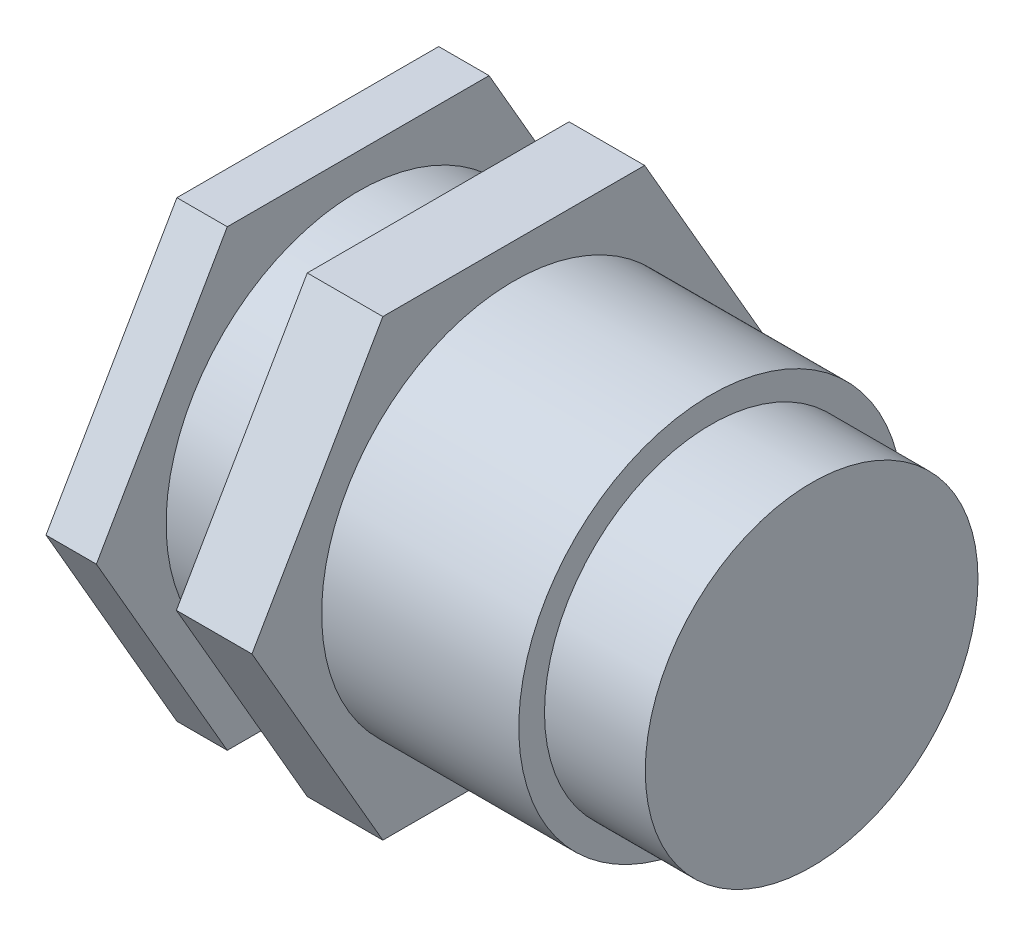
ISO-10303-21;
HEADER;
FILE_DESCRIPTION(('STEP AP214'),'2;1');
FILE_NAME('part.step','',(''),(''),'','','');
FILE_SCHEMA(('AUTOMOTIVE_DESIGN { 1 0 10303 214 1 1 1 1 }'));
ENDSEC;
DATA;
#1=APPLICATION_CONTEXT('core data for automotive mechanical design processes');
#2=APPLICATION_PROTOCOL_DEFINITION('international standard','automotive_design',2000,#1);
#3=PRODUCT_CONTEXT('',#1,'mechanical');
#4=PRODUCT('Part','Part','',(#3));
#5=PRODUCT_RELATED_PRODUCT_CATEGORY('part','',(#4));
#6=PRODUCT_DEFINITION_FORMATION('','',#4);
#7=PRODUCT_DEFINITION_CONTEXT('part definition',#1,'design');
#8=PRODUCT_DEFINITION('design','',#6,#7);
#9=PRODUCT_DEFINITION_SHAPE('','',#8);
#10=(LENGTH_UNIT() NAMED_UNIT(*) SI_UNIT(.MILLI.,.METRE.));
#11=(NAMED_UNIT(*) PLANE_ANGLE_UNIT() SI_UNIT($,.RADIAN.));
#12=(NAMED_UNIT(*) SI_UNIT($,.STERADIAN.) SOLID_ANGLE_UNIT());
#13=UNCERTAINTY_MEASURE_WITH_UNIT(LENGTH_MEASURE(1.E-05),#10,'distance_accuracy_value','');
#14=(GEOMETRIC_REPRESENTATION_CONTEXT(3) GLOBAL_UNCERTAINTY_ASSIGNED_CONTEXT((#13)) GLOBAL_UNIT_ASSIGNED_CONTEXT((#10,
#11,#12)) REPRESENTATION_CONTEXT('',''));
#15=CARTESIAN_POINT('',(0.,0.,0.));
#16=DIRECTION('',(0.,0.,1.));
#17=DIRECTION('',(1.,0.,0.));
#18=AXIS2_PLACEMENT_3D('',#15,#16,#17);
#19=CARTESIAN_POINT('',(16.,0.,0.));
#20=DIRECTION('',(-1.,0.,0.));
#21=DIRECTION('',(0.,0.,1.));
#22=AXIS2_PLACEMENT_3D('',#19,#20,#21);
#23=CYLINDRICAL_SURFACE('',#22,7.625);
#24=CARTESIAN_POINT('',(8.175,0.,0.));
#25=DIRECTION('',(1.,0.,0.));
#26=DIRECTION('',(0.,0.,-1.));
#27=AXIS2_PLACEMENT_3D('',#24,#25,#26);
#28=CIRCLE('',#27,7.625);
#29=CARTESIAN_POINT('',(8.175,0.,-7.625));
#30=VERTEX_POINT('',#29);
#31=EDGE_CURVE('E39',#30,#30,#28,.T.);
#32=ORIENTED_EDGE('',*,*,#31,.T.);
#33=EDGE_LOOP('',(#32));
#34=FACE_BOUND('',#33,.T.);
#35=CARTESIAN_POINT('',(16.,0.,0.));
#36=DIRECTION('',(1.,0.,0.));
#37=DIRECTION('',(0.,0.,-1.));
#38=AXIS2_PLACEMENT_3D('',#35,#36,#37);
#39=CIRCLE('',#38,7.625);
#40=CARTESIAN_POINT('',(16.,0.,-7.625));
#41=VERTEX_POINT('',#40);
#42=EDGE_CURVE('E130',#41,#41,#39,.T.);
#43=ORIENTED_EDGE('',*,*,#42,.F.);
#44=EDGE_LOOP('',(#43));
#45=FACE_BOUND('',#44,.T.);
#46=ADVANCED_FACE('F35',(#34,#45),#23,.T.);
#47=CARTESIAN_POINT('',(16.,0.,0.));
#48=DIRECTION('',(1.,0.,0.));
#49=DIRECTION('',(0.,0.,-1.));
#50=AXIS2_PLACEMENT_3D('',#47,#48,#49);
#51=PLANE('',#50);
#52=CARTESIAN_POINT('',(16.,0.,0.));
#53=DIRECTION('',(1.,0.,0.));
#54=DIRECTION('',(0.,0.,-1.));
#55=AXIS2_PLACEMENT_3D('',#52,#53,#54);
#56=CIRCLE('',#55,6.604);
#57=CARTESIAN_POINT('',(16.,0.,-6.604));
#58=VERTEX_POINT('',#57);
#59=EDGE_CURVE('E45',#58,#58,#56,.T.);
#60=ORIENTED_EDGE('',*,*,#59,.F.);
#61=EDGE_LOOP('',(#60));
#62=FACE_BOUND('',#61,.T.);
#63=ORIENTED_EDGE('',*,*,#42,.T.);
#64=EDGE_LOOP('',(#63));
#65=FACE_BOUND('',#64,.T.);
#66=ADVANCED_FACE('F177',(#62,#65),#51,.T.);
#67=CARTESIAN_POINT('',(58.6789327318238,0.,0.));
#68=DIRECTION('',(-1.,0.,0.));
#69=DIRECTION('',(0.,0.,1.));
#70=AXIS2_PLACEMENT_3D('',#67,#68,#69);
#71=CYLINDRICAL_SURFACE('',#70,6.604);
#72=ORIENTED_EDGE('',*,*,#59,.T.);
#73=EDGE_LOOP('',(#72));
#74=FACE_BOUND('',#73,.T.);
#75=CARTESIAN_POINT('',(20.,0.,0.));
#76=DIRECTION('',(1.,0.,0.));
#77=DIRECTION('',(0.,0.,-1.));
#78=AXIS2_PLACEMENT_3D('',#75,#76,#77);
#79=CIRCLE('',#78,6.604);
#80=CARTESIAN_POINT('',(20.,0.,-6.604));
#81=VERTEX_POINT('',#80);
#82=EDGE_CURVE('E252',#81,#81,#79,.T.);
#83=ORIENTED_EDGE('',*,*,#82,.F.);
#84=EDGE_LOOP('',(#83));
#85=FACE_BOUND('',#84,.T.);
#86=ADVANCED_FACE('F184',(#74,#85),#71,.T.);
#87=CARTESIAN_POINT('',(20.,0.,0.));
#88=DIRECTION('',(1.,0.,0.));
#89=DIRECTION('',(0.,0.,-1.));
#90=AXIS2_PLACEMENT_3D('',#87,#88,#89);
#91=PLANE('',#90);
#92=ORIENTED_EDGE('',*,*,#82,.T.);
#93=EDGE_LOOP('',(#92));
#94=FACE_BOUND('',#93,.T.);
#95=ADVANCED_FACE('F330',(#94),#91,.T.);
#96=CARTESIAN_POINT('',(8.175,-9.000000034,-5.19615244233654));
#97=DIRECTION('',(0.,0.5,0.866025403784439));
#98=DIRECTION('',(0.,-0.866025403784439,0.5));
#99=AXIS2_PLACEMENT_3D('',#96,#97,#98);
#100=PLANE('',#99);
#101=DIRECTION('',(0.,0.866025403784439,-0.5));
#102=VECTOR('',#101,1.);
#103=CARTESIAN_POINT('',(5.175,-9.000000034,-5.19615244233654));
#104=LINE('',#103,#102);
#105=CARTESIAN_POINT('',(5.175,-9.000000034,-5.19615244233654));
#106=VERTEX_POINT('',#105);
#107=CARTESIAN_POINT('',(5.175,0.,-10.3923048846731));
#108=VERTEX_POINT('',#107);
#109=EDGE_CURVE('E206',#106,#108,#104,.T.);
#110=ORIENTED_EDGE('',*,*,#109,.T.);
#111=DIRECTION('',(-1.,0.,0.));
#112=VECTOR('',#111,1.);
#113=CARTESIAN_POINT('',(8.175,0.,-10.3923048846731));
#114=LINE('',#113,#112);
#115=CARTESIAN_POINT('',(8.175,0.,-10.3923048846731));
#116=VERTEX_POINT('',#115);
#117=EDGE_CURVE('E251',#116,#108,#114,.T.);
#118=ORIENTED_EDGE('',*,*,#117,.F.);
#119=DIRECTION('',(0.,0.866025403784439,-0.5));
#120=VECTOR('',#119,1.);
#121=CARTESIAN_POINT('',(8.175,-9.000000034,-5.19615244233654));
#122=LINE('',#121,#120);
#123=CARTESIAN_POINT('',(8.175,-9.000000034,-5.19615244233654));
#124=VERTEX_POINT('',#123);
#125=EDGE_CURVE('E236',#124,#116,#122,.T.);
#126=ORIENTED_EDGE('',*,*,#125,.F.);
#127=DIRECTION('',(-1.,0.,0.));
#128=VECTOR('',#127,1.);
#129=CARTESIAN_POINT('',(8.175,-9.000000034,-5.19615244233654));
#130=LINE('',#129,#128);
#131=EDGE_CURVE('E237',#124,#106,#130,.T.);
#132=ORIENTED_EDGE('',*,*,#131,.T.);
#133=EDGE_LOOP('',(#110,#118,#126,#132));
#134=FACE_BOUND('',#133,.T.);
#135=ADVANCED_FACE('F277',(#134),#100,.F.);
#136=CARTESIAN_POINT('',(8.175,0.,-10.3923048846731));
#137=DIRECTION('',(0.,-0.5,0.866025403784438));
#138=DIRECTION('',(0.,-0.866025403784439,-0.5));
#139=AXIS2_PLACEMENT_3D('',#136,#137,#138);
#140=PLANE('',#139);
#141=DIRECTION('',(0.,0.866025403784438,0.5));
#142=VECTOR('',#141,1.);
#143=CARTESIAN_POINT('',(5.175,0.,-10.3923048846731));
#144=LINE('',#143,#142);
#145=CARTESIAN_POINT('',(5.175,9.000000034,-5.19615244233654));
#146=VERTEX_POINT('',#145);
#147=EDGE_CURVE('E214',#108,#146,#144,.T.);
#148=ORIENTED_EDGE('',*,*,#147,.T.);
#149=DIRECTION('',(-1.,0.,0.));
#150=VECTOR('',#149,1.);
#151=CARTESIAN_POINT('',(8.175,9.000000034,-5.19615244233654));
#152=LINE('',#151,#150);
#153=CARTESIAN_POINT('',(8.175,9.000000034,-5.19615244233654));
#154=VERTEX_POINT('',#153);
#155=EDGE_CURVE('E248',#154,#146,#152,.T.);
#156=ORIENTED_EDGE('',*,*,#155,.F.);
#157=DIRECTION('',(0.,0.866025403784438,0.5));
#158=VECTOR('',#157,1.);
#159=CARTESIAN_POINT('',(8.175,0.,-10.3923048846731));
#160=LINE('',#159,#158);
#161=EDGE_CURVE('E270',#116,#154,#160,.T.);
#162=ORIENTED_EDGE('',*,*,#161,.F.);
#163=ORIENTED_EDGE('',*,*,#117,.T.);
#164=EDGE_LOOP('',(#148,#156,#162,#163));
#165=FACE_BOUND('',#164,.T.);
#166=ADVANCED_FACE('F279',(#165),#140,.F.);
#167=CARTESIAN_POINT('',(8.175,9.000000034,-5.19615244233654));
#168=DIRECTION('',(0.,-1.,0.));
#169=DIRECTION('',(0.,0.,-1.));
#170=AXIS2_PLACEMENT_3D('',#167,#168,#169);
#171=PLANE('',#170);
#172=DIRECTION('',(0.,0.,1.));
#173=VECTOR('',#172,1.);
#174=CARTESIAN_POINT('',(5.175,9.000000034,-5.19615244233654));
#175=LINE('',#174,#173);
#176=CARTESIAN_POINT('',(5.175,9.000000034,5.19615244233654));
#177=VERTEX_POINT('',#176);
#178=EDGE_CURVE('E221',#146,#177,#175,.T.);
#179=ORIENTED_EDGE('',*,*,#178,.T.);
#180=DIRECTION('',(-1.,0.,0.));
#181=VECTOR('',#180,1.);
#182=CARTESIAN_POINT('',(8.175,9.000000034,5.19615244233654));
#183=LINE('',#182,#181);
#184=CARTESIAN_POINT('',(8.175,9.000000034,5.19615244233654));
#185=VERTEX_POINT('',#184);
#186=EDGE_CURVE('E245',#185,#177,#183,.T.);
#187=ORIENTED_EDGE('',*,*,#186,.F.);
#188=DIRECTION('',(0.,0.,1.));
#189=VECTOR('',#188,1.);
#190=CARTESIAN_POINT('',(8.175,9.000000034,-5.19615244233654));
#191=LINE('',#190,#189);
#192=EDGE_CURVE('E301',#154,#185,#191,.T.);
#193=ORIENTED_EDGE('',*,*,#192,.F.);
#194=ORIENTED_EDGE('',*,*,#155,.T.);
#195=EDGE_LOOP('',(#179,#187,#193,#194));
#196=FACE_BOUND('',#195,.T.);
#197=ADVANCED_FACE('F311',(#196),#171,.F.);
#198=CARTESIAN_POINT('',(8.175,9.000000034,5.19615244233654));
#199=DIRECTION('',(0.,-0.5,-0.866025403784438));
#200=DIRECTION('',(0.,0.866025403784439,-0.5));
#201=AXIS2_PLACEMENT_3D('',#198,#199,#200);
#202=PLANE('',#201);
#203=DIRECTION('',(0.,-0.866025403784439,0.5));
#204=VECTOR('',#203,1.);
#205=CARTESIAN_POINT('',(5.175,9.000000034,5.19615244233654));
#206=LINE('',#205,#204);
#207=CARTESIAN_POINT('',(5.175,0.,10.3923048846731));
#208=VERTEX_POINT('',#207);
#209=EDGE_CURVE('E229',#177,#208,#206,.T.);
#210=ORIENTED_EDGE('',*,*,#209,.T.);
#211=DIRECTION('',(-1.,0.,0.));
#212=VECTOR('',#211,1.);
#213=CARTESIAN_POINT('',(8.175,0.,10.3923048846731));
#214=LINE('',#213,#212);
#215=CARTESIAN_POINT('',(8.175,0.,10.3923048846731));
#216=VERTEX_POINT('',#215);
#217=EDGE_CURVE('E242',#216,#208,#214,.T.);
#218=ORIENTED_EDGE('',*,*,#217,.F.);
#219=DIRECTION('',(0.,-0.866025403784439,0.5));
#220=VECTOR('',#219,1.);
#221=CARTESIAN_POINT('',(8.175,9.000000034,5.19615244233654));
#222=LINE('',#221,#220);
#223=EDGE_CURVE('E299',#185,#216,#222,.T.);
#224=ORIENTED_EDGE('',*,*,#223,.F.);
#225=ORIENTED_EDGE('',*,*,#186,.T.);
#226=EDGE_LOOP('',(#210,#218,#224,#225));
#227=FACE_BOUND('',#226,.T.);
#228=ADVANCED_FACE('F313',(#227),#202,.F.);
#229=CARTESIAN_POINT('',(8.175,0.,10.3923048846731));
#230=DIRECTION('',(0.,0.5,-0.866025403784439));
#231=DIRECTION('',(0.,0.866025403784439,0.5));
#232=AXIS2_PLACEMENT_3D('',#229,#230,#231);
#233=PLANE('',#232);
#234=DIRECTION('',(0.,-0.866025403784438,-0.5));
#235=VECTOR('',#234,1.);
#236=CARTESIAN_POINT('',(5.175,0.,10.3923048846731));
#237=LINE('',#236,#235);
#238=CARTESIAN_POINT('',(5.175,-9.000000034,5.19615244233654));
#239=VERTEX_POINT('',#238);
#240=EDGE_CURVE('E232',#208,#239,#237,.T.);
#241=ORIENTED_EDGE('',*,*,#240,.T.);
#242=DIRECTION('',(-1.,0.,0.));
#243=VECTOR('',#242,1.);
#244=CARTESIAN_POINT('',(8.175,-9.000000034,5.19615244233654));
#245=LINE('',#244,#243);
#246=CARTESIAN_POINT('',(8.175,-9.000000034,5.19615244233654));
#247=VERTEX_POINT('',#246);
#248=EDGE_CURVE('E239',#247,#239,#245,.T.);
#249=ORIENTED_EDGE('',*,*,#248,.F.);
#250=DIRECTION('',(0.,-0.866025403784438,-0.5));
#251=VECTOR('',#250,1.);
#252=CARTESIAN_POINT('',(8.175,0.,10.3923048846731));
#253=LINE('',#252,#251);
#254=EDGE_CURVE('E298',#216,#247,#253,.T.);
#255=ORIENTED_EDGE('',*,*,#254,.F.);
#256=ORIENTED_EDGE('',*,*,#217,.T.);
#257=EDGE_LOOP('',(#241,#249,#255,#256));
#258=FACE_BOUND('',#257,.T.);
#259=ADVANCED_FACE('F291',(#258),#233,.F.);
#260=CARTESIAN_POINT('',(8.175,-9.000000034,5.19615244233654));
#261=DIRECTION('',(0.,1.,0.));
#262=DIRECTION('',(0.,0.,1.));
#263=AXIS2_PLACEMENT_3D('',#260,#261,#262);
#264=PLANE('',#263);
#265=DIRECTION('',(0.,0.,-1.));
#266=VECTOR('',#265,1.);
#267=CARTESIAN_POINT('',(5.175,-9.000000034,5.19615244233654));
#268=LINE('',#267,#266);
#269=EDGE_CURVE('E210',#239,#106,#268,.T.);
#270=ORIENTED_EDGE('',*,*,#269,.T.);
#271=ORIENTED_EDGE('',*,*,#131,.F.);
#272=DIRECTION('',(0.,0.,-1.));
#273=VECTOR('',#272,1.);
#274=CARTESIAN_POINT('',(8.175,-9.000000034,5.19615244233654));
#275=LINE('',#274,#273);
#276=EDGE_CURVE('E224',#247,#124,#275,.T.);
#277=ORIENTED_EDGE('',*,*,#276,.F.);
#278=ORIENTED_EDGE('',*,*,#248,.T.);
#279=EDGE_LOOP('',(#270,#271,#277,#278));
#280=FACE_BOUND('',#279,.T.);
#281=ADVANCED_FACE('F261',(#280),#264,.F.);
#282=CARTESIAN_POINT('',(8.175,0.,0.));
#283=DIRECTION('',(1.,0.,0.));
#284=DIRECTION('',(0.,0.,-1.));
#285=AXIS2_PLACEMENT_3D('',#282,#283,#284);
#286=PLANE('',#285);
#287=ORIENTED_EDGE('',*,*,#31,.F.);
#288=EDGE_LOOP('',(#287));
#289=FACE_BOUND('',#288,.T.);
#290=ORIENTED_EDGE('',*,*,#125,.T.);
#291=ORIENTED_EDGE('',*,*,#161,.T.);
#292=ORIENTED_EDGE('',*,*,#192,.T.);
#293=ORIENTED_EDGE('',*,*,#223,.T.);
#294=ORIENTED_EDGE('',*,*,#254,.T.);
#295=ORIENTED_EDGE('',*,*,#276,.T.);
#296=EDGE_LOOP('',(#290,#291,#292,#293,#294,#295));
#297=FACE_BOUND('',#296,.T.);
#298=ADVANCED_FACE('F200',(#289,#297),#286,.T.);
#299=CARTESIAN_POINT('',(5.175,0.,0.));
#300=DIRECTION('',(1.,0.,0.));
#301=DIRECTION('',(0.,0.,-1.));
#302=AXIS2_PLACEMENT_3D('',#299,#300,#301);
#303=PLANE('',#302);
#304=CARTESIAN_POINT('',(5.175,0.,0.));
#305=DIRECTION('',(1.,0.,0.));
#306=DIRECTION('',(0.,0.,-1.));
#307=AXIS2_PLACEMENT_3D('',#304,#305,#306);
#308=CIRCLE('',#307,7.625);
#309=CARTESIAN_POINT('',(5.175,0.,-7.625));
#310=VERTEX_POINT('',#309);
#311=EDGE_CURVE('E12',#310,#310,#308,.T.);
#312=ORIENTED_EDGE('',*,*,#311,.T.);
#313=EDGE_LOOP('',(#312));
#314=FACE_BOUND('',#313,.T.);
#315=ORIENTED_EDGE('',*,*,#109,.F.);
#316=ORIENTED_EDGE('',*,*,#269,.F.);
#317=ORIENTED_EDGE('',*,*,#240,.F.);
#318=ORIENTED_EDGE('',*,*,#209,.F.);
#319=ORIENTED_EDGE('',*,*,#178,.F.);
#320=ORIENTED_EDGE('',*,*,#147,.F.);
#321=EDGE_LOOP('',(#315,#316,#317,#318,#319,#320));
#322=FACE_BOUND('',#321,.T.);
#323=ADVANCED_FACE('F174',(#314,#322),#303,.F.);
#324=CARTESIAN_POINT('',(0.,0.,0.));
#325=DIRECTION('',(1.,0.,0.));
#326=DIRECTION('',(0.,0.,-1.));
#327=AXIS2_PLACEMENT_3D('',#324,#325,#326);
#328=PLANE('',#327);
#329=DIRECTION('',(0.,0.866025403784438,0.5));
#330=VECTOR('',#329,1.);
#331=CARTESIAN_POINT('',(0.,0.,-10.3923048846731));
#332=LINE('',#331,#330);
#333=CARTESIAN_POINT('',(0.,0.,-10.3923048846731));
#334=VERTEX_POINT('',#333);
#335=CARTESIAN_POINT('',(0.,9.000000034,-5.19615244233654));
#336=VERTEX_POINT('',#335);
#337=EDGE_CURVE('E126',#334,#336,#332,.T.);
#338=ORIENTED_EDGE('',*,*,#337,.F.);
#339=DIRECTION('',(0.,0.866025403784439,-0.5));
#340=VECTOR('',#339,1.);
#341=CARTESIAN_POINT('',(0.,-9.000000034,-5.19615244233654));
#342=LINE('',#341,#340);
#343=CARTESIAN_POINT('',(0.,-9.000000034,-5.19615244233654));
#344=VERTEX_POINT('',#343);
#345=EDGE_CURVE('E83',#344,#334,#342,.T.);
#346=ORIENTED_EDGE('',*,*,#345,.F.);
#347=DIRECTION('',(0.,0.,-1.));
#348=VECTOR('',#347,1.);
#349=CARTESIAN_POINT('',(0.,-9.000000034,5.19615244233654));
#350=LINE('',#349,#348);
#351=CARTESIAN_POINT('',(0.,-9.000000034,5.19615244233654));
#352=VERTEX_POINT('',#351);
#353=EDGE_CURVE('E77',#352,#344,#350,.T.);
#354=ORIENTED_EDGE('',*,*,#353,.F.);
#355=DIRECTION('',(0.,-0.866025403784438,-0.5));
#356=VECTOR('',#355,1.);
#357=CARTESIAN_POINT('',(0.,0.,10.3923048846731));
#358=LINE('',#357,#356);
#359=CARTESIAN_POINT('',(0.,0.,10.3923048846731));
#360=VERTEX_POINT('',#359);
#361=EDGE_CURVE('E116',#360,#352,#358,.T.);
#362=ORIENTED_EDGE('',*,*,#361,.F.);
#363=DIRECTION('',(0.,-0.866025403784439,0.5));
#364=VECTOR('',#363,1.);
#365=CARTESIAN_POINT('',(0.,9.000000034,5.19615244233654));
#366=LINE('',#365,#364);
#367=CARTESIAN_POINT('',(0.,9.000000034,5.19615244233654));
#368=VERTEX_POINT('',#367);
#369=EDGE_CURVE('E132',#368,#360,#366,.T.);
#370=ORIENTED_EDGE('',*,*,#369,.F.);
#371=DIRECTION('',(0.,0.,1.));
#372=VECTOR('',#371,1.);
#373=CARTESIAN_POINT('',(0.,9.000000034,-5.19615244233654));
#374=LINE('',#373,#372);
#375=EDGE_CURVE('E129',#336,#368,#374,.T.);
#376=ORIENTED_EDGE('',*,*,#375,.F.);
#377=EDGE_LOOP('',(#338,#346,#354,#362,#370,#376));
#378=FACE_BOUND('',#377,.T.);
#379=ADVANCED_FACE('F164',(#378),#328,.F.);
#380=CARTESIAN_POINT('',(2.,-9.000000034,-5.19615244233654));
#381=DIRECTION('',(0.,0.5,0.866025403784439));
#382=DIRECTION('',(0.,-0.866025403784439,0.5));
#383=AXIS2_PLACEMENT_3D('',#380,#381,#382);
#384=PLANE('',#383);
#385=ORIENTED_EDGE('',*,*,#345,.T.);
#386=DIRECTION('',(-1.,0.,0.));
#387=VECTOR('',#386,1.);
#388=CARTESIAN_POINT('',(2.,0.,-10.3923048846731));
#389=LINE('',#388,#387);
#390=CARTESIAN_POINT('',(2.,0.,-10.3923048846731));
#391=VERTEX_POINT('',#390);
#392=EDGE_CURVE('E122',#391,#334,#389,.T.);
#393=ORIENTED_EDGE('',*,*,#392,.F.);
#394=DIRECTION('',(0.,0.866025403784439,-0.5));
#395=VECTOR('',#394,1.);
#396=CARTESIAN_POINT('',(2.,-9.000000034,-5.19615244233654));
#397=LINE('',#396,#395);
#398=CARTESIAN_POINT('',(2.,-9.000000034,-5.19615244233654));
#399=VERTEX_POINT('',#398);
#400=EDGE_CURVE('E53',#399,#391,#397,.T.);
#401=ORIENTED_EDGE('',*,*,#400,.F.);
#402=DIRECTION('',(-1.,0.,0.));
#403=VECTOR('',#402,1.);
#404=CARTESIAN_POINT('',(2.,-9.000000034,-5.19615244233654));
#405=LINE('',#404,#403);
#406=EDGE_CURVE('E118',#399,#344,#405,.T.);
#407=ORIENTED_EDGE('',*,*,#406,.T.);
#408=EDGE_LOOP('',(#385,#393,#401,#407));
#409=FACE_BOUND('',#408,.T.);
#410=ADVANCED_FACE('F166',(#409),#384,.F.);
#411=CARTESIAN_POINT('',(2.,-9.000000034,5.19615244233654));
#412=DIRECTION('',(0.,1.,0.));
#413=DIRECTION('',(0.,0.,1.));
#414=AXIS2_PLACEMENT_3D('',#411,#412,#413);
#415=PLANE('',#414);
#416=ORIENTED_EDGE('',*,*,#353,.T.);
#417=ORIENTED_EDGE('',*,*,#406,.F.);
#418=DIRECTION('',(0.,0.,-1.));
#419=VECTOR('',#418,1.);
#420=CARTESIAN_POINT('',(2.,-9.000000034,5.19615244233654));
#421=LINE('',#420,#419);
#422=CARTESIAN_POINT('',(2.,-9.000000034,5.19615244233654));
#423=VERTEX_POINT('',#422);
#424=EDGE_CURVE('E106',#423,#399,#421,.T.);
#425=ORIENTED_EDGE('',*,*,#424,.F.);
#426=DIRECTION('',(-1.,0.,0.));
#427=VECTOR('',#426,1.);
#428=CARTESIAN_POINT('',(2.,-9.000000034,5.19615244233654));
#429=LINE('',#428,#427);
#430=EDGE_CURVE('E113',#423,#352,#429,.T.);
#431=ORIENTED_EDGE('',*,*,#430,.T.);
#432=EDGE_LOOP('',(#416,#417,#425,#431));
#433=FACE_BOUND('',#432,.T.);
#434=ADVANCED_FACE('F120',(#433),#415,.F.);
#435=CARTESIAN_POINT('',(2.,0.,10.3923048846731));
#436=DIRECTION('',(0.,0.5,-0.866025403784438));
#437=DIRECTION('',(0.,0.866025403784439,0.5));
#438=AXIS2_PLACEMENT_3D('',#435,#436,#437);
#439=PLANE('',#438);
#440=ORIENTED_EDGE('',*,*,#361,.T.);
#441=ORIENTED_EDGE('',*,*,#430,.F.);
#442=DIRECTION('',(0.,-0.866025403784438,-0.5));
#443=VECTOR('',#442,1.);
#444=CARTESIAN_POINT('',(2.,0.,10.3923048846731));
#445=LINE('',#444,#443);
#446=CARTESIAN_POINT('',(2.,0.,10.3923048846731));
#447=VERTEX_POINT('',#446);
#448=EDGE_CURVE('E102',#447,#423,#445,.T.);
#449=ORIENTED_EDGE('',*,*,#448,.F.);
#450=DIRECTION('',(-1.,0.,0.));
#451=VECTOR('',#450,1.);
#452=CARTESIAN_POINT('',(2.,0.,10.3923048846731));
#453=LINE('',#452,#451);
#454=EDGE_CURVE('E117',#447,#360,#453,.T.);
#455=ORIENTED_EDGE('',*,*,#454,.T.);
#456=EDGE_LOOP('',(#440,#441,#449,#455));
#457=FACE_BOUND('',#456,.T.);
#458=ADVANCED_FACE('F114',(#457),#439,.F.);
#459=CARTESIAN_POINT('',(2.,9.000000034,5.19615244233654));
#460=DIRECTION('',(0.,-0.5,-0.866025403784439));
#461=DIRECTION('',(0.,0.866025403784439,-0.5));
#462=AXIS2_PLACEMENT_3D('',#459,#460,#461);
#463=PLANE('',#462);
#464=ORIENTED_EDGE('',*,*,#369,.T.);
#465=ORIENTED_EDGE('',*,*,#454,.F.);
#466=DIRECTION('',(0.,-0.866025403784439,0.5));
#467=VECTOR('',#466,1.);
#468=CARTESIAN_POINT('',(2.,9.000000034,5.19615244233654));
#469=LINE('',#468,#467);
#470=CARTESIAN_POINT('',(2.,9.000000034,5.19615244233654));
#471=VERTEX_POINT('',#470);
#472=EDGE_CURVE('E108',#471,#447,#469,.T.);
#473=ORIENTED_EDGE('',*,*,#472,.F.);
#474=DIRECTION('',(-1.,0.,0.));
#475=VECTOR('',#474,1.);
#476=CARTESIAN_POINT('',(2.,9.000000034,5.19615244233654));
#477=LINE('',#476,#475);
#478=EDGE_CURVE('E141',#471,#368,#477,.T.);
#479=ORIENTED_EDGE('',*,*,#478,.T.);
#480=EDGE_LOOP('',(#464,#465,#473,#479));
#481=FACE_BOUND('',#480,.T.);
#482=ADVANCED_FACE('F161',(#481),#463,.F.);
#483=CARTESIAN_POINT('',(2.,9.000000034,-5.19615244233654));
#484=DIRECTION('',(0.,-1.,0.));
#485=DIRECTION('',(0.,0.,-1.));
#486=AXIS2_PLACEMENT_3D('',#483,#484,#485);
#487=PLANE('',#486);
#488=ORIENTED_EDGE('',*,*,#375,.T.);
#489=ORIENTED_EDGE('',*,*,#478,.F.);
#490=DIRECTION('',(0.,0.,1.));
#491=VECTOR('',#490,1.);
#492=CARTESIAN_POINT('',(2.,9.000000034,-5.19615244233654));
#493=LINE('',#492,#491);
#494=CARTESIAN_POINT('',(2.,9.000000034,-5.19615244233654));
#495=VERTEX_POINT('',#494);
#496=EDGE_CURVE('E92',#495,#471,#493,.T.);
#497=ORIENTED_EDGE('',*,*,#496,.F.);
#498=DIRECTION('',(-1.,0.,0.));
#499=VECTOR('',#498,1.);
#500=CARTESIAN_POINT('',(2.,9.000000034,-5.19615244233654));
#501=LINE('',#500,#499);
#502=EDGE_CURVE('E144',#495,#336,#501,.T.);
#503=ORIENTED_EDGE('',*,*,#502,.T.);
#504=EDGE_LOOP('',(#488,#489,#497,#503));
#505=FACE_BOUND('',#504,.T.);
#506=ADVANCED_FACE('F158',(#505),#487,.F.);
#507=CARTESIAN_POINT('',(2.,0.,-10.3923048846731));
#508=DIRECTION('',(0.,-0.5,0.866025403784438));
#509=DIRECTION('',(0.,-0.866025403784438,-0.5));
#510=AXIS2_PLACEMENT_3D('',#507,#508,#509);
#511=PLANE('',#510);
#512=ORIENTED_EDGE('',*,*,#337,.T.);
#513=ORIENTED_EDGE('',*,*,#502,.F.);
#514=DIRECTION('',(0.,0.866025403784438,0.5));
#515=VECTOR('',#514,1.);
#516=CARTESIAN_POINT('',(2.,0.,-10.3923048846731));
#517=LINE('',#516,#515);
#518=EDGE_CURVE('E137',#391,#495,#517,.T.);
#519=ORIENTED_EDGE('',*,*,#518,.F.);
#520=ORIENTED_EDGE('',*,*,#392,.T.);
#521=EDGE_LOOP('',(#512,#513,#519,#520));
#522=FACE_BOUND('',#521,.T.);
#523=ADVANCED_FACE('F37',(#522),#511,.F.);
#524=CARTESIAN_POINT('',(2.,0.,0.));
#525=DIRECTION('',(1.,0.,0.));
#526=DIRECTION('',(0.,0.,-1.));
#527=AXIS2_PLACEMENT_3D('',#524,#525,#526);
#528=PLANE('',#527);
#529=CARTESIAN_POINT('',(2.,0.,0.));
#530=DIRECTION('',(1.,0.,0.));
#531=DIRECTION('',(0.,0.,-1.));
#532=AXIS2_PLACEMENT_3D('',#529,#530,#531);
#533=CIRCLE('',#532,7.625);
#534=CARTESIAN_POINT('',(2.,0.,-7.625));
#535=VERTEX_POINT('',#534);
#536=EDGE_CURVE('E145',#535,#535,#533,.T.);
#537=ORIENTED_EDGE('',*,*,#536,.F.);
#538=EDGE_LOOP('',(#537));
#539=FACE_BOUND('',#538,.T.);
#540=ORIENTED_EDGE('',*,*,#518,.T.);
#541=ORIENTED_EDGE('',*,*,#496,.T.);
#542=ORIENTED_EDGE('',*,*,#472,.T.);
#543=ORIENTED_EDGE('',*,*,#448,.T.);
#544=ORIENTED_EDGE('',*,*,#424,.T.);
#545=ORIENTED_EDGE('',*,*,#400,.T.);
#546=EDGE_LOOP('',(#540,#541,#542,#543,#544,#545));
#547=FACE_BOUND('',#546,.T.);
#548=ADVANCED_FACE('F104',(#539,#547),#528,.T.);
#549=ORIENTED_EDGE('',*,*,#536,.T.);
#550=EDGE_LOOP('',(#549));
#551=FACE_BOUND('',#550,.T.);
#552=ORIENTED_EDGE('',*,*,#311,.F.);
#553=EDGE_LOOP('',(#552));
#554=FACE_BOUND('',#553,.T.);
#555=ADVANCED_FACE('F180',(#551,#554),#23,.T.);
#556=CLOSED_SHELL('',(#46,#66,#86,#95,#135,#166,#197,#228,#259,#281,#298,#323,#379,#410,#434,
#458,#482,#506,#523,#548,#555));
#557=MANIFOLD_SOLID_BREP('B2',#556);
#558=ADVANCED_BREP_SHAPE_REPRESENTATION('',(#18,#557),#14);
#559=SHAPE_DEFINITION_REPRESENTATION(#9,#558);
ENDSEC;
END-ISO-10303-21;
